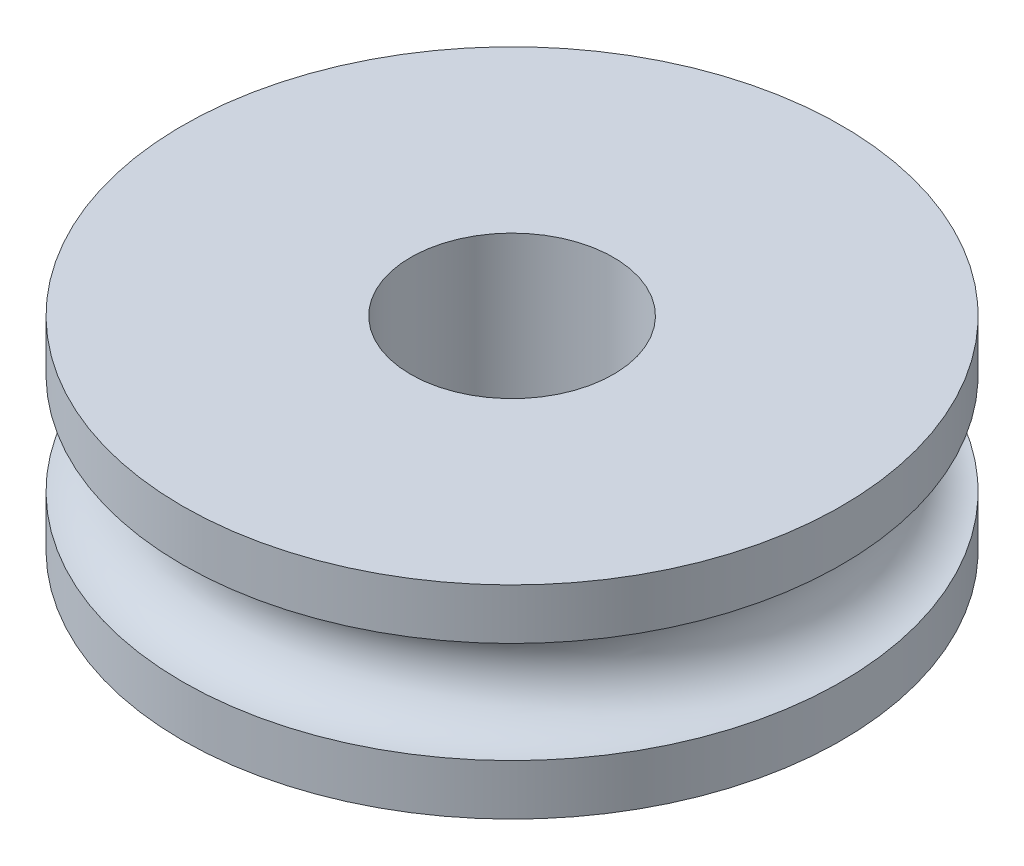
ISO-10303-21;
HEADER;
FILE_DESCRIPTION(('STEP AP214'),'2;1');
FILE_NAME('part.step','',(''),(''),'','','');
FILE_SCHEMA(('AUTOMOTIVE_DESIGN { 1 0 10303 214 1 1 1 1 }'));
ENDSEC;
DATA;
#1=APPLICATION_CONTEXT('core data for automotive mechanical design processes');
#2=APPLICATION_PROTOCOL_DEFINITION('international standard','automotive_design',2000,#1);
#3=PRODUCT_CONTEXT('',#1,'mechanical');
#4=PRODUCT('Part','Part','',(#3));
#5=PRODUCT_RELATED_PRODUCT_CATEGORY('part','',(#4));
#6=PRODUCT_DEFINITION_FORMATION('','',#4);
#7=PRODUCT_DEFINITION_CONTEXT('part definition',#1,'design');
#8=PRODUCT_DEFINITION('design','',#6,#7);
#9=PRODUCT_DEFINITION_SHAPE('','',#8);
#10=(LENGTH_UNIT() NAMED_UNIT(*) SI_UNIT(.MILLI.,.METRE.));
#11=(NAMED_UNIT(*) PLANE_ANGLE_UNIT() SI_UNIT($,.RADIAN.));
#12=(NAMED_UNIT(*) SI_UNIT($,.STERADIAN.) SOLID_ANGLE_UNIT());
#13=UNCERTAINTY_MEASURE_WITH_UNIT(LENGTH_MEASURE(1.E-05),#10,'distance_accuracy_value','');
#14=(GEOMETRIC_REPRESENTATION_CONTEXT(3) GLOBAL_UNCERTAINTY_ASSIGNED_CONTEXT((#13)) GLOBAL_UNIT_ASSIGNED_CONTEXT((#10,
#11,#12)) REPRESENTATION_CONTEXT('',''));
#15=CARTESIAN_POINT('',(0.,0.,0.));
#16=DIRECTION('',(0.,0.,1.));
#17=DIRECTION('',(1.,0.,0.));
#18=AXIS2_PLACEMENT_3D('',#15,#16,#17);
#19=CARTESIAN_POINT('',(74.5,50.02643198464,-44.43));
#20=DIRECTION('',(0.,1.,0.));
#21=DIRECTION('',(0.,0.,1.));
#22=AXIS2_PLACEMENT_3D('',#19,#20,#21);
#23=CYLINDRICAL_SURFACE('',#22,6.50000000000001);
#24=CARTESIAN_POINT('',(74.5,54.52643198464,-44.43));
#25=DIRECTION('',(0.,1.,0.));
#26=DIRECTION('',(0.,0.,1.));
#27=AXIS2_PLACEMENT_3D('',#24,#25,#26);
#28=CIRCLE('',#27,6.50000000000001);
#29=CARTESIAN_POINT('',(74.5,54.52643198464,-37.93));
#30=VERTEX_POINT('',#29);
#31=EDGE_CURVE('E17',#30,#30,#28,.F.);
#32=ORIENTED_EDGE('',*,*,#31,.T.);
#33=EDGE_LOOP('',(#32));
#34=FACE_BOUND('',#33,.T.);
#35=CARTESIAN_POINT('',(74.5,53.52643198464,-44.43));
#36=DIRECTION('',(0.,1.,0.));
#37=DIRECTION('',(0.,0.,1.));
#38=AXIS2_PLACEMENT_3D('',#35,#36,#37);
#39=CIRCLE('',#38,6.50000000000001);
#40=CARTESIAN_POINT('',(74.5,53.52643198464,-37.93));
#41=VERTEX_POINT('',#40);
#42=EDGE_CURVE('E32',#41,#41,#39,.T.);
#43=ORIENTED_EDGE('',*,*,#42,.T.);
#44=EDGE_LOOP('',(#43));
#45=FACE_BOUND('',#44,.T.);
#46=ADVANCED_FACE('F14',(#34,#45),#23,.T.);
#47=CARTESIAN_POINT('',(74.5,52.52643198464,-44.43));
#48=DIRECTION('',(0.,1.,0.));
#49=DIRECTION('',(1.,0.,0.));
#50=AXIS2_PLACEMENT_3D('',#47,#48,#49);
#51=TOROIDAL_SURFACE('',#50,6.50000000000001,1.);
#52=ORIENTED_EDGE('',*,*,#42,.F.);
#53=EDGE_LOOP('',(#52));
#54=FACE_BOUND('',#53,.T.);
#55=CARTESIAN_POINT('',(74.5,51.52643198464,-44.43));
#56=DIRECTION('',(0.,1.,0.));
#57=DIRECTION('',(0.,0.,1.));
#58=AXIS2_PLACEMENT_3D('',#55,#56,#57);
#59=CIRCLE('',#58,6.50000000000001);
#60=CARTESIAN_POINT('',(74.5,51.52643198464,-37.93));
#61=VERTEX_POINT('',#60);
#62=EDGE_CURVE('E36',#61,#61,#59,.F.);
#63=ORIENTED_EDGE('',*,*,#62,.F.);
#64=EDGE_LOOP('',(#63));
#65=FACE_BOUND('',#64,.T.);
#66=ADVANCED_FACE('F48',(#54,#65),#51,.F.);
#67=CARTESIAN_POINT('',(83.5,54.52643198464,-52.35926627001));
#68=DIRECTION('',(0.,-1.,0.));
#69=DIRECTION('',(0.,0.,-1.));
#70=AXIS2_PLACEMENT_3D('',#67,#68,#69);
#71=PLANE('',#70);
#72=CARTESIAN_POINT('',(74.5,54.52643198464,-44.43));
#73=DIRECTION('',(0.,1.,0.));
#74=DIRECTION('',(0.,0.,1.));
#75=AXIS2_PLACEMENT_3D('',#72,#73,#74);
#76=CIRCLE('',#75,2.);
#77=CARTESIAN_POINT('',(74.5,54.52643198464,-42.43));
#78=VERTEX_POINT('',#77);
#79=EDGE_CURVE('E29',#78,#78,#76,.F.);
#80=ORIENTED_EDGE('',*,*,#79,.T.);
#81=EDGE_LOOP('',(#80));
#82=FACE_BOUND('',#81,.T.);
#83=ORIENTED_EDGE('',*,*,#31,.F.);
#84=EDGE_LOOP('',(#83));
#85=FACE_BOUND('',#84,.T.);
#86=ADVANCED_FACE('F51',(#82,#85),#71,.F.);
#87=CARTESIAN_POINT('',(74.5,50.02643198464,-44.43));
#88=DIRECTION('',(0.,1.,0.));
#89=DIRECTION('',(0.,0.,1.));
#90=AXIS2_PLACEMENT_3D('',#87,#88,#89);
#91=CYLINDRICAL_SURFACE('',#90,6.50000000000001);
#92=CARTESIAN_POINT('',(74.5,50.52643198464,-44.43));
#93=DIRECTION('',(0.,1.,0.));
#94=DIRECTION('',(0.,0.,1.));
#95=AXIS2_PLACEMENT_3D('',#92,#93,#94);
#96=CIRCLE('',#95,6.50000000000001);
#97=CARTESIAN_POINT('',(74.5,50.52643198464,-37.93));
#98=VERTEX_POINT('',#97);
#99=EDGE_CURVE('E22',#98,#98,#96,.T.);
#100=ORIENTED_EDGE('',*,*,#99,.T.);
#101=EDGE_LOOP('',(#100));
#102=FACE_BOUND('',#101,.T.);
#103=ORIENTED_EDGE('',*,*,#62,.T.);
#104=EDGE_LOOP('',(#103));
#105=FACE_BOUND('',#104,.T.);
#106=ADVANCED_FACE('F55',(#102,#105),#91,.T.);
#107=CARTESIAN_POINT('',(74.5,50.02643198464,-44.43));
#108=DIRECTION('',(0.,1.,0.));
#109=DIRECTION('',(0.,0.,1.));
#110=AXIS2_PLACEMENT_3D('',#107,#108,#109);
#111=CYLINDRICAL_SURFACE('',#110,2.);
#112=CARTESIAN_POINT('',(74.5,50.52643198464,-44.43));
#113=DIRECTION('',(0.,1.,0.));
#114=DIRECTION('',(0.,0.,1.));
#115=AXIS2_PLACEMENT_3D('',#112,#113,#114);
#116=CIRCLE('',#115,2.);
#117=CARTESIAN_POINT('',(74.5,50.52643198464,-42.43));
#118=VERTEX_POINT('',#117);
#119=EDGE_CURVE('E10',#118,#118,#116,.F.);
#120=ORIENTED_EDGE('',*,*,#119,.T.);
#121=EDGE_LOOP('',(#120));
#122=FACE_BOUND('',#121,.T.);
#123=ORIENTED_EDGE('',*,*,#79,.F.);
#124=EDGE_LOOP('',(#123));
#125=FACE_BOUND('',#124,.T.);
#126=ADVANCED_FACE('F58',(#122,#125),#111,.F.);
#127=CARTESIAN_POINT('',(83.5,50.52643198464,-37.31836938706));
#128=DIRECTION('',(0.,1.,0.));
#129=DIRECTION('',(0.,0.,1.));
#130=AXIS2_PLACEMENT_3D('',#127,#128,#129);
#131=PLANE('',#130);
#132=ORIENTED_EDGE('',*,*,#119,.F.);
#133=EDGE_LOOP('',(#132));
#134=FACE_BOUND('',#133,.T.);
#135=ORIENTED_EDGE('',*,*,#99,.F.);
#136=EDGE_LOOP('',(#135));
#137=FACE_BOUND('',#136,.T.);
#138=ADVANCED_FACE('F62',(#134,#137),#131,.F.);
#139=CLOSED_SHELL('',(#46,#66,#86,#106,#126,#138));
#140=MANIFOLD_SOLID_BREP('B1',#139);
#141=ADVANCED_BREP_SHAPE_REPRESENTATION('',(#18,#140),#14);
#142=SHAPE_DEFINITION_REPRESENTATION(#9,#141);
ENDSEC;
END-ISO-10303-21;
